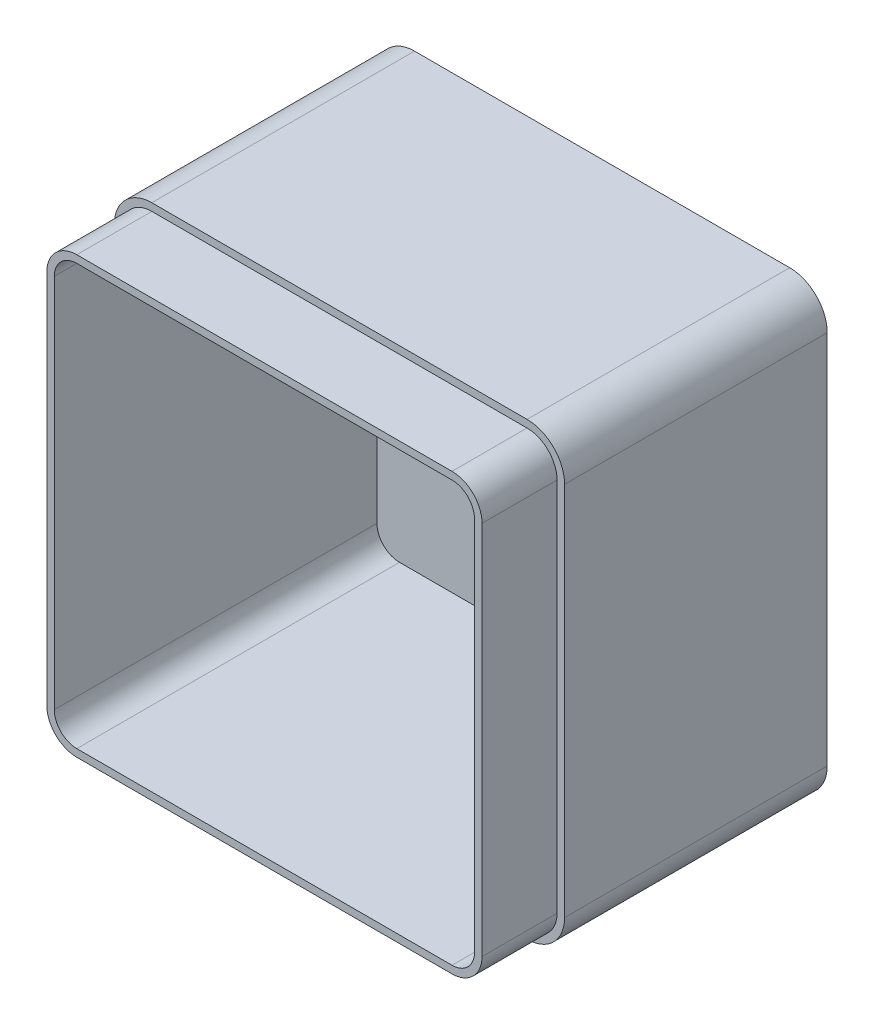
ISO-10303-21;
HEADER;
FILE_DESCRIPTION(('STEP AP214'),'2;1');
FILE_NAME('part.step','',(''),(''),'','','');
FILE_SCHEMA(('AUTOMOTIVE_DESIGN { 1 0 10303 214 1 1 1 1 }'));
ENDSEC;
DATA;
#1=APPLICATION_CONTEXT('core data for automotive mechanical design processes');
#2=APPLICATION_PROTOCOL_DEFINITION('international standard','automotive_design',2000,#1);
#3=PRODUCT_CONTEXT('',#1,'mechanical');
#4=PRODUCT('Part','Part','',(#3));
#5=PRODUCT_RELATED_PRODUCT_CATEGORY('part','',(#4));
#6=PRODUCT_DEFINITION_FORMATION('','',#4);
#7=PRODUCT_DEFINITION_CONTEXT('part definition',#1,'design');
#8=PRODUCT_DEFINITION('design','',#6,#7);
#9=PRODUCT_DEFINITION_SHAPE('','',#8);
#10=(LENGTH_UNIT() NAMED_UNIT(*) SI_UNIT(.MILLI.,.METRE.));
#11=(NAMED_UNIT(*) PLANE_ANGLE_UNIT() SI_UNIT($,.RADIAN.));
#12=(NAMED_UNIT(*) SI_UNIT($,.STERADIAN.) SOLID_ANGLE_UNIT());
#13=UNCERTAINTY_MEASURE_WITH_UNIT(LENGTH_MEASURE(1.E-05),#10,'distance_accuracy_value','');
#14=(GEOMETRIC_REPRESENTATION_CONTEXT(3) GLOBAL_UNCERTAINTY_ASSIGNED_CONTEXT((#13)) GLOBAL_UNIT_ASSIGNED_CONTEXT((#10,
#11,#12)) REPRESENTATION_CONTEXT('',''));
#15=CARTESIAN_POINT('',(0.,0.,0.));
#16=DIRECTION('',(0.,0.,1.));
#17=DIRECTION('',(1.,0.,0.));
#18=AXIS2_PLACEMENT_3D('',#15,#16,#17);
#19=CARTESIAN_POINT('',(0.,0.,90.));
#20=DIRECTION('',(0.,0.,-1.));
#21=DIRECTION('',(-1.,0.,0.));
#22=AXIS2_PLACEMENT_3D('',#19,#20,#21);
#23=PLANE('',#22);
#24=DIRECTION('',(1.,0.,0.));
#25=VECTOR('',#24,1.);
#26=CARTESIAN_POINT('',(0.,4.,90.));
#27=LINE('',#26,#25);
#28=CARTESIAN_POINT('',(9.99999999999999,4.,90.));
#29=VERTEX_POINT('',#28);
#30=CARTESIAN_POINT('',(110.,4.,90.));
#31=VERTEX_POINT('',#30);
#32=EDGE_CURVE('E385',#29,#31,#27,.T.);
#33=ORIENTED_EDGE('',*,*,#32,.F.);
#34=CARTESIAN_POINT('',(9.99999999999999,10.,90.));
#35=DIRECTION('',(0.,0.,-1.));
#36=DIRECTION('',(-1.,0.,0.));
#37=AXIS2_PLACEMENT_3D('',#34,#35,#36);
#38=CIRCLE('',#37,6.);
#39=CARTESIAN_POINT('',(4.,10.,90.));
#40=VERTEX_POINT('',#39);
#41=EDGE_CURVE('E386',#40,#29,#38,.F.);
#42=ORIENTED_EDGE('',*,*,#41,.F.);
#43=DIRECTION('',(0.,-1.,0.));
#44=VECTOR('',#43,1.);
#45=CARTESIAN_POINT('',(4.,0.,90.));
#46=LINE('',#45,#44);
#47=CARTESIAN_POINT('',(3.99999999999996,110.,90.));
#48=VERTEX_POINT('',#47);
#49=EDGE_CURVE('E358',#48,#40,#46,.T.);
#50=ORIENTED_EDGE('',*,*,#49,.F.);
#51=CARTESIAN_POINT('',(9.99999999999996,110.,90.));
#52=DIRECTION('',(0.,0.,-1.));
#53=DIRECTION('',(-1.,0.,0.));
#54=AXIS2_PLACEMENT_3D('',#51,#52,#53);
#55=CIRCLE('',#54,6.);
#56=CARTESIAN_POINT('',(9.99999999999996,116.,90.));
#57=VERTEX_POINT('',#56);
#58=EDGE_CURVE('E389',#57,#48,#55,.F.);
#59=ORIENTED_EDGE('',*,*,#58,.F.);
#60=DIRECTION('',(-1.,0.,0.));
#61=VECTOR('',#60,1.);
#62=CARTESIAN_POINT('',(0.,116.,90.));
#63=LINE('',#62,#61);
#64=CARTESIAN_POINT('',(110.,116.,90.));
#65=VERTEX_POINT('',#64);
#66=EDGE_CURVE('E375',#65,#57,#63,.T.);
#67=ORIENTED_EDGE('',*,*,#66,.F.);
#68=CARTESIAN_POINT('',(110.,110.,90.));
#69=DIRECTION('',(0.,0.,-1.));
#70=DIRECTION('',(-1.,0.,0.));
#71=AXIS2_PLACEMENT_3D('',#68,#69,#70);
#72=CIRCLE('',#71,6.);
#73=CARTESIAN_POINT('',(116.,110.,90.));
#74=VERTEX_POINT('',#73);
#75=EDGE_CURVE('E365',#74,#65,#72,.F.);
#76=ORIENTED_EDGE('',*,*,#75,.F.);
#77=DIRECTION('',(0.,1.,0.));
#78=VECTOR('',#77,1.);
#79=CARTESIAN_POINT('',(116.,0.,90.));
#80=LINE('',#79,#78);
#81=CARTESIAN_POINT('',(116.,10.,90.));
#82=VERTEX_POINT('',#81);
#83=EDGE_CURVE('E393',#82,#74,#80,.T.);
#84=ORIENTED_EDGE('',*,*,#83,.F.);
#85=CARTESIAN_POINT('',(110.,10.,90.));
#86=DIRECTION('',(0.,0.,-1.));
#87=DIRECTION('',(-1.,0.,0.));
#88=AXIS2_PLACEMENT_3D('',#85,#86,#87);
#89=CIRCLE('',#88,6.);
#90=EDGE_CURVE('E335',#31,#82,#89,.F.);
#91=ORIENTED_EDGE('',*,*,#90,.F.);
#92=EDGE_LOOP('',(#33,#42,#50,#59,#67,#76,#84,#91));
#93=FACE_BOUND('',#92,.T.);
#94=CARTESIAN_POINT('',(9.99999999999999,10.,90.));
#95=DIRECTION('',(0.,0.,1.));
#96=DIRECTION('',(1.,0.,0.));
#97=AXIS2_PLACEMENT_3D('',#94,#95,#96);
#98=CIRCLE('',#97,8.00000000000001);
#99=CARTESIAN_POINT('',(1.99999999999996,9.99999999999999,90.));
#100=VERTEX_POINT('',#99);
#101=CARTESIAN_POINT('',(9.99999999999999,2.,90.));
#102=VERTEX_POINT('',#101);
#103=EDGE_CURVE('E257',#100,#102,#98,.T.);
#104=ORIENTED_EDGE('',*,*,#103,.T.);
#105=DIRECTION('',(1.,0.,0.));
#106=VECTOR('',#105,1.);
#107=CARTESIAN_POINT('',(9.99999999999999,2.,90.));
#108=LINE('',#107,#106);
#109=CARTESIAN_POINT('',(110.,2.,90.));
#110=VERTEX_POINT('',#109);
#111=EDGE_CURVE('E207',#102,#110,#108,.T.);
#112=ORIENTED_EDGE('',*,*,#111,.T.);
#113=CARTESIAN_POINT('',(110.,10.,90.));
#114=DIRECTION('',(0.,0.,1.));
#115=DIRECTION('',(1.,0.,0.));
#116=AXIS2_PLACEMENT_3D('',#113,#114,#115);
#117=CIRCLE('',#116,7.99999999999999);
#118=CARTESIAN_POINT('',(118.,10.,90.));
#119=VERTEX_POINT('',#118);
#120=EDGE_CURVE('E55',#110,#119,#117,.T.);
#121=ORIENTED_EDGE('',*,*,#120,.T.);
#122=DIRECTION('',(0.,1.,0.));
#123=VECTOR('',#122,1.);
#124=CARTESIAN_POINT('',(118.,9.99999999999999,90.));
#125=LINE('',#124,#123);
#126=CARTESIAN_POINT('',(118.,110.,90.));
#127=VERTEX_POINT('',#126);
#128=EDGE_CURVE('E264',#119,#127,#125,.T.);
#129=ORIENTED_EDGE('',*,*,#128,.T.);
#130=CARTESIAN_POINT('',(110.,110.,90.));
#131=DIRECTION('',(0.,0.,1.));
#132=DIRECTION('',(1.,0.,0.));
#133=AXIS2_PLACEMENT_3D('',#130,#131,#132);
#134=CIRCLE('',#133,8.00000000000001);
#135=CARTESIAN_POINT('',(110.,118.,90.));
#136=VERTEX_POINT('',#135);
#137=EDGE_CURVE('E268',#127,#136,#134,.T.);
#138=ORIENTED_EDGE('',*,*,#137,.T.);
#139=DIRECTION('',(-1.,0.,0.));
#140=VECTOR('',#139,1.);
#141=CARTESIAN_POINT('',(110.,118.,90.));
#142=LINE('',#141,#140);
#143=CARTESIAN_POINT('',(9.99999999999995,118.,90.));
#144=VERTEX_POINT('',#143);
#145=EDGE_CURVE('E272',#136,#144,#142,.T.);
#146=ORIENTED_EDGE('',*,*,#145,.T.);
#147=CARTESIAN_POINT('',(9.99999999999996,110.,90.));
#148=DIRECTION('',(0.,0.,1.));
#149=DIRECTION('',(1.,0.,0.));
#150=AXIS2_PLACEMENT_3D('',#147,#148,#149);
#151=CIRCLE('',#150,7.99999999999999);
#152=CARTESIAN_POINT('',(1.99999999999997,110.,90.));
#153=VERTEX_POINT('',#152);
#154=EDGE_CURVE('E234',#144,#153,#151,.T.);
#155=ORIENTED_EDGE('',*,*,#154,.T.);
#156=DIRECTION('',(0.,-1.,0.));
#157=VECTOR('',#156,1.);
#158=CARTESIAN_POINT('',(1.99999999999996,110.,90.));
#159=LINE('',#158,#157);
#160=EDGE_CURVE('E230',#153,#100,#159,.T.);
#161=ORIENTED_EDGE('',*,*,#160,.T.);
#162=EDGE_LOOP('',(#104,#112,#121,#129,#138,#146,#155,#161));
#163=FACE_BOUND('',#162,.T.);
#164=ADVANCED_FACE('F39',(#93,#163),#23,.F.);
#165=CARTESIAN_POINT('',(4.,0.,90.));
#166=DIRECTION('',(1.,0.,0.));
#167=DIRECTION('',(0.,1.,0.));
#168=AXIS2_PLACEMENT_3D('',#165,#166,#167);
#169=PLANE('',#168);
#170=DIRECTION('',(0.,-1.,0.));
#171=VECTOR('',#170,1.);
#172=CARTESIAN_POINT('',(4.,0.,4.));
#173=LINE('',#172,#171);
#174=CARTESIAN_POINT('',(3.99999999999996,110.,4.));
#175=VERTEX_POINT('',#174);
#176=CARTESIAN_POINT('',(4.,10.,4.));
#177=VERTEX_POINT('',#176);
#178=EDGE_CURVE('E321',#175,#177,#173,.T.);
#179=ORIENTED_EDGE('',*,*,#178,.F.);
#180=DIRECTION('',(0.,0.,1.));
#181=VECTOR('',#180,1.);
#182=CARTESIAN_POINT('',(3.99999999999996,110.,90.));
#183=LINE('',#182,#181);
#184=EDGE_CURVE('E331',#48,#175,#183,.F.);
#185=ORIENTED_EDGE('',*,*,#184,.F.);
#186=ORIENTED_EDGE('',*,*,#49,.T.);
#187=DIRECTION('',(0.,0.,1.));
#188=VECTOR('',#187,1.);
#189=CARTESIAN_POINT('',(4.,10.,90.));
#190=LINE('',#189,#188);
#191=EDGE_CURVE('E326',#177,#40,#190,.T.);
#192=ORIENTED_EDGE('',*,*,#191,.F.);
#193=EDGE_LOOP('',(#179,#185,#186,#192));
#194=FACE_BOUND('',#193,.T.);
#195=ADVANCED_FACE('F504',(#194),#169,.T.);
#196=CARTESIAN_POINT('',(0.,4.,90.));
#197=DIRECTION('',(0.,1.,0.));
#198=DIRECTION('',(0.,0.,1.));
#199=AXIS2_PLACEMENT_3D('',#196,#197,#198);
#200=PLANE('',#199);
#201=DIRECTION('',(1.,0.,0.));
#202=VECTOR('',#201,1.);
#203=CARTESIAN_POINT('',(0.,4.,4.));
#204=LINE('',#203,#202);
#205=CARTESIAN_POINT('',(9.99999999999999,4.,4.));
#206=VERTEX_POINT('',#205);
#207=CARTESIAN_POINT('',(110.,4.,4.));
#208=VERTEX_POINT('',#207);
#209=EDGE_CURVE('E325',#206,#208,#204,.T.);
#210=ORIENTED_EDGE('',*,*,#209,.F.);
#211=DIRECTION('',(0.,0.,1.));
#212=VECTOR('',#211,1.);
#213=CARTESIAN_POINT('',(9.99999999999999,4.,90.));
#214=LINE('',#213,#212);
#215=EDGE_CURVE('E344',#29,#206,#214,.F.);
#216=ORIENTED_EDGE('',*,*,#215,.F.);
#217=ORIENTED_EDGE('',*,*,#32,.T.);
#218=DIRECTION('',(0.,0.,1.));
#219=VECTOR('',#218,1.);
#220=CARTESIAN_POINT('',(110.,4.,90.));
#221=LINE('',#220,#219);
#222=EDGE_CURVE('E362',#208,#31,#221,.T.);
#223=ORIENTED_EDGE('',*,*,#222,.F.);
#224=EDGE_LOOP('',(#210,#216,#217,#223));
#225=FACE_BOUND('',#224,.T.);
#226=ADVANCED_FACE('F510',(#225),#200,.T.);
#227=CARTESIAN_POINT('',(116.,0.,90.));
#228=DIRECTION('',(-1.,0.,0.));
#229=DIRECTION('',(0.,-1.,0.));
#230=AXIS2_PLACEMENT_3D('',#227,#228,#229);
#231=PLANE('',#230);
#232=ORIENTED_EDGE('',*,*,#83,.T.);
#233=DIRECTION('',(0.,0.,1.));
#234=VECTOR('',#233,1.);
#235=CARTESIAN_POINT('',(116.,110.,90.));
#236=LINE('',#235,#234);
#237=CARTESIAN_POINT('',(116.,110.,4.));
#238=VERTEX_POINT('',#237);
#239=EDGE_CURVE('E372',#238,#74,#236,.T.);
#240=ORIENTED_EDGE('',*,*,#239,.F.);
#241=DIRECTION('',(0.,1.,0.));
#242=VECTOR('',#241,1.);
#243=CARTESIAN_POINT('',(116.,0.,4.));
#244=LINE('',#243,#242);
#245=CARTESIAN_POINT('',(116.,10.,4.));
#246=VERTEX_POINT('',#245);
#247=EDGE_CURVE('E336',#246,#238,#244,.T.);
#248=ORIENTED_EDGE('',*,*,#247,.F.);
#249=DIRECTION('',(0.,0.,1.));
#250=VECTOR('',#249,1.);
#251=CARTESIAN_POINT('',(116.,10.,90.));
#252=LINE('',#251,#250);
#253=EDGE_CURVE('E361',#82,#246,#252,.F.);
#254=ORIENTED_EDGE('',*,*,#253,.F.);
#255=EDGE_LOOP('',(#232,#240,#248,#254));
#256=FACE_BOUND('',#255,.T.);
#257=ADVANCED_FACE('F704',(#256),#231,.T.);
#258=CARTESIAN_POINT('',(0.,116.,90.));
#259=DIRECTION('',(0.,-1.,0.));
#260=DIRECTION('',(0.,0.,-1.));
#261=AXIS2_PLACEMENT_3D('',#258,#259,#260);
#262=PLANE('',#261);
#263=DIRECTION('',(-1.,0.,0.));
#264=VECTOR('',#263,1.);
#265=CARTESIAN_POINT('',(0.,116.,4.));
#266=LINE('',#265,#264);
#267=CARTESIAN_POINT('',(110.,116.,4.));
#268=VERTEX_POINT('',#267);
#269=CARTESIAN_POINT('',(9.99999999999996,116.,4.));
#270=VERTEX_POINT('',#269);
#271=EDGE_CURVE('E340',#268,#270,#266,.T.);
#272=ORIENTED_EDGE('',*,*,#271,.F.);
#273=DIRECTION('',(0.,0.,-1.));
#274=VECTOR('',#273,1.);
#275=CARTESIAN_POINT('',(110.,116.,90.));
#276=LINE('',#275,#274);
#277=EDGE_CURVE('E330',#65,#268,#276,.T.);
#278=ORIENTED_EDGE('',*,*,#277,.F.);
#279=ORIENTED_EDGE('',*,*,#66,.T.);
#280=DIRECTION('',(0.,0.,-1.));
#281=VECTOR('',#280,1.);
#282=CARTESIAN_POINT('',(9.99999999999996,116.,90.));
#283=LINE('',#282,#281);
#284=EDGE_CURVE('E379',#270,#57,#283,.F.);
#285=ORIENTED_EDGE('',*,*,#284,.F.);
#286=EDGE_LOOP('',(#272,#278,#279,#285));
#287=FACE_BOUND('',#286,.T.);
#288=ADVANCED_FACE('F694',(#287),#262,.T.);
#289=CARTESIAN_POINT('',(0.,0.,4.));
#290=DIRECTION('',(0.,0.,-1.));
#291=DIRECTION('',(-1.,0.,0.));
#292=AXIS2_PLACEMENT_3D('',#289,#290,#291);
#293=PLANE('',#292);
#294=ORIENTED_EDGE('',*,*,#247,.T.);
#295=CARTESIAN_POINT('',(110.,110.,4.));
#296=DIRECTION('',(0.,0.,-1.));
#297=DIRECTION('',(-1.,0.,0.));
#298=AXIS2_PLACEMENT_3D('',#295,#296,#297);
#299=CIRCLE('',#298,6.);
#300=EDGE_CURVE('E354',#268,#238,#299,.T.);
#301=ORIENTED_EDGE('',*,*,#300,.F.);
#302=ORIENTED_EDGE('',*,*,#271,.T.);
#303=CARTESIAN_POINT('',(9.99999999999996,110.,4.));
#304=DIRECTION('',(0.,0.,-1.));
#305=DIRECTION('',(-1.,0.,0.));
#306=AXIS2_PLACEMENT_3D('',#303,#304,#305);
#307=CIRCLE('',#306,6.);
#308=EDGE_CURVE('E351',#175,#270,#307,.T.);
#309=ORIENTED_EDGE('',*,*,#308,.F.);
#310=ORIENTED_EDGE('',*,*,#178,.T.);
#311=CARTESIAN_POINT('',(9.99999999999999,10.,4.));
#312=DIRECTION('',(0.,0.,-1.));
#313=DIRECTION('',(-1.,0.,0.));
#314=AXIS2_PLACEMENT_3D('',#311,#312,#313);
#315=CIRCLE('',#314,6.);
#316=EDGE_CURVE('E345',#206,#177,#315,.T.);
#317=ORIENTED_EDGE('',*,*,#316,.F.);
#318=ORIENTED_EDGE('',*,*,#209,.T.);
#319=CARTESIAN_POINT('',(110.,10.,4.));
#320=DIRECTION('',(0.,0.,-1.));
#321=DIRECTION('',(-1.,0.,0.));
#322=AXIS2_PLACEMENT_3D('',#319,#320,#321);
#323=CIRCLE('',#322,6.);
#324=EDGE_CURVE('E341',#246,#208,#323,.T.);
#325=ORIENTED_EDGE('',*,*,#324,.F.);
#326=EDGE_LOOP('',(#294,#301,#302,#309,#310,#317,#318,#325));
#327=FACE_BOUND('',#326,.T.);
#328=ADVANCED_FACE('F684',(#327),#293,.F.);
#329=CARTESIAN_POINT('',(110.,10.,90.));
#330=DIRECTION('',(0.,0.,-1.));
#331=DIRECTION('',(-1.,0.,0.));
#332=AXIS2_PLACEMENT_3D('',#329,#330,#331);
#333=CYLINDRICAL_SURFACE('',#332,6.);
#334=ORIENTED_EDGE('',*,*,#90,.T.);
#335=ORIENTED_EDGE('',*,*,#253,.T.);
#336=ORIENTED_EDGE('',*,*,#324,.T.);
#337=ORIENTED_EDGE('',*,*,#222,.T.);
#338=EDGE_LOOP('',(#334,#335,#336,#337));
#339=FACE_BOUND('',#338,.T.);
#340=ADVANCED_FACE('F674',(#339),#333,.F.);
#341=CARTESIAN_POINT('',(9.99999999999999,10.,90.));
#342=DIRECTION('',(0.,0.,-1.));
#343=DIRECTION('',(-1.,0.,0.));
#344=AXIS2_PLACEMENT_3D('',#341,#342,#343);
#345=CYLINDRICAL_SURFACE('',#344,6.);
#346=ORIENTED_EDGE('',*,*,#41,.T.);
#347=ORIENTED_EDGE('',*,*,#215,.T.);
#348=ORIENTED_EDGE('',*,*,#316,.T.);
#349=ORIENTED_EDGE('',*,*,#191,.T.);
#350=EDGE_LOOP('',(#346,#347,#348,#349));
#351=FACE_BOUND('',#350,.T.);
#352=ADVANCED_FACE('F665',(#351),#345,.F.);
#353=CARTESIAN_POINT('',(9.99999999999996,110.,90.));
#354=DIRECTION('',(0.,0.,-1.));
#355=DIRECTION('',(-1.,0.,0.));
#356=AXIS2_PLACEMENT_3D('',#353,#354,#355);
#357=CYLINDRICAL_SURFACE('',#356,6.);
#358=ORIENTED_EDGE('',*,*,#58,.T.);
#359=ORIENTED_EDGE('',*,*,#184,.T.);
#360=ORIENTED_EDGE('',*,*,#308,.T.);
#361=ORIENTED_EDGE('',*,*,#284,.T.);
#362=EDGE_LOOP('',(#358,#359,#360,#361));
#363=FACE_BOUND('',#362,.T.);
#364=ADVANCED_FACE('F656',(#363),#357,.F.);
#365=CARTESIAN_POINT('',(110.,110.,90.));
#366=DIRECTION('',(0.,0.,-1.));
#367=DIRECTION('',(-1.,0.,0.));
#368=AXIS2_PLACEMENT_3D('',#365,#366,#367);
#369=CYLINDRICAL_SURFACE('',#368,6.);
#370=ORIENTED_EDGE('',*,*,#75,.T.);
#371=ORIENTED_EDGE('',*,*,#277,.T.);
#372=ORIENTED_EDGE('',*,*,#300,.T.);
#373=ORIENTED_EDGE('',*,*,#239,.T.);
#374=EDGE_LOOP('',(#370,#371,#372,#373));
#375=FACE_BOUND('',#374,.T.);
#376=ADVANCED_FACE('F517',(#375),#369,.F.);
#377=CARTESIAN_POINT('',(9.99999999999999,10.,70.));
#378=DIRECTION('',(0.,0.,1.));
#379=DIRECTION('',(1.,0.,0.));
#380=AXIS2_PLACEMENT_3D('',#377,#378,#379);
#381=PLANE('',#380);
#382=DIRECTION('',(0.,-1.,0.));
#383=VECTOR('',#382,1.);
#384=CARTESIAN_POINT('',(1.99999999999996,110.,70.));
#385=LINE('',#384,#383);
#386=CARTESIAN_POINT('',(1.99999999999997,110.,70.));
#387=VERTEX_POINT('',#386);
#388=CARTESIAN_POINT('',(1.99999999999996,9.99999999999999,70.));
#389=VERTEX_POINT('',#388);
#390=EDGE_CURVE('E214',#387,#389,#385,.T.);
#391=ORIENTED_EDGE('',*,*,#390,.F.);
#392=CARTESIAN_POINT('',(9.99999999999996,110.,70.));
#393=DIRECTION('',(0.,0.,1.));
#394=DIRECTION('',(1.,0.,0.));
#395=AXIS2_PLACEMENT_3D('',#392,#393,#394);
#396=CIRCLE('',#395,7.99999999999999);
#397=CARTESIAN_POINT('',(9.99999999999995,118.,70.));
#398=VERTEX_POINT('',#397);
#399=EDGE_CURVE('E251',#398,#387,#396,.T.);
#400=ORIENTED_EDGE('',*,*,#399,.F.);
#401=DIRECTION('',(-1.,0.,0.));
#402=VECTOR('',#401,1.);
#403=CARTESIAN_POINT('',(110.,118.,70.));
#404=LINE('',#403,#402);
#405=CARTESIAN_POINT('',(110.,118.,70.));
#406=VERTEX_POINT('',#405);
#407=EDGE_CURVE('E247',#406,#398,#404,.T.);
#408=ORIENTED_EDGE('',*,*,#407,.F.);
#409=CARTESIAN_POINT('',(110.,110.,70.));
#410=DIRECTION('',(0.,0.,1.));
#411=DIRECTION('',(1.,0.,0.));
#412=AXIS2_PLACEMENT_3D('',#409,#410,#411);
#413=CIRCLE('',#412,8.00000000000001);
#414=CARTESIAN_POINT('',(118.,110.,70.));
#415=VERTEX_POINT('',#414);
#416=EDGE_CURVE('E243',#415,#406,#413,.T.);
#417=ORIENTED_EDGE('',*,*,#416,.F.);
#418=DIRECTION('',(0.,1.,0.));
#419=VECTOR('',#418,1.);
#420=CARTESIAN_POINT('',(118.,9.99999999999999,70.));
#421=LINE('',#420,#419);
#422=CARTESIAN_POINT('',(118.,10.,70.));
#423=VERTEX_POINT('',#422);
#424=EDGE_CURVE('E239',#423,#415,#421,.T.);
#425=ORIENTED_EDGE('',*,*,#424,.F.);
#426=CARTESIAN_POINT('',(110.,10.,70.));
#427=DIRECTION('',(0.,0.,1.));
#428=DIRECTION('',(1.,0.,0.));
#429=AXIS2_PLACEMENT_3D('',#426,#427,#428);
#430=CIRCLE('',#429,7.99999999999999);
#431=CARTESIAN_POINT('',(110.,2.,70.));
#432=VERTEX_POINT('',#431);
#433=EDGE_CURVE('E224',#432,#423,#430,.T.);
#434=ORIENTED_EDGE('',*,*,#433,.F.);
#435=DIRECTION('',(1.,0.,0.));
#436=VECTOR('',#435,1.);
#437=CARTESIAN_POINT('',(9.99999999999999,2.,70.));
#438=LINE('',#437,#436);
#439=CARTESIAN_POINT('',(9.99999999999999,2.,70.));
#440=VERTEX_POINT('',#439);
#441=EDGE_CURVE('E205',#440,#432,#438,.T.);
#442=ORIENTED_EDGE('',*,*,#441,.F.);
#443=CARTESIAN_POINT('',(9.99999999999999,10.,70.));
#444=DIRECTION('',(0.,0.,1.));
#445=DIRECTION('',(1.,0.,0.));
#446=AXIS2_PLACEMENT_3D('',#443,#444,#445);
#447=CIRCLE('',#446,8.00000000000001);
#448=EDGE_CURVE('E220',#389,#440,#447,.T.);
#449=ORIENTED_EDGE('',*,*,#448,.F.);
#450=EDGE_LOOP('',(#391,#400,#408,#417,#425,#434,#442,#449));
#451=FACE_BOUND('',#450,.T.);
#452=CARTESIAN_POINT('',(9.99999999999999,10.,70.));
#453=DIRECTION('',(0.,0.,1.));
#454=DIRECTION('',(1.,0.,0.));
#455=AXIS2_PLACEMENT_3D('',#452,#453,#454);
#456=CIRCLE('',#455,10.);
#457=CARTESIAN_POINT('',(0.,9.99999999999999,70.));
#458=VERTEX_POINT('',#457);
#459=CARTESIAN_POINT('',(9.99999999999999,0.,70.));
#460=VERTEX_POINT('',#459);
#461=EDGE_CURVE('E281',#458,#460,#456,.T.);
#462=ORIENTED_EDGE('',*,*,#461,.T.);
#463=DIRECTION('',(1.,0.,0.));
#464=VECTOR('',#463,1.);
#465=CARTESIAN_POINT('',(9.99999999999999,0.,70.));
#466=LINE('',#465,#464);
#467=CARTESIAN_POINT('',(110.,0.,70.));
#468=VERTEX_POINT('',#467);
#469=EDGE_CURVE('E301',#460,#468,#466,.T.);
#470=ORIENTED_EDGE('',*,*,#469,.T.);
#471=CARTESIAN_POINT('',(110.,10.,70.));
#472=DIRECTION('',(0.,0.,1.));
#473=DIRECTION('',(1.,0.,0.));
#474=AXIS2_PLACEMENT_3D('',#471,#472,#473);
#475=CIRCLE('',#474,9.99999999999999);
#476=CARTESIAN_POINT('',(120.,10.,70.));
#477=VERTEX_POINT('',#476);
#478=EDGE_CURVE('E304',#468,#477,#475,.T.);
#479=ORIENTED_EDGE('',*,*,#478,.T.);
#480=DIRECTION('',(0.,1.,0.));
#481=VECTOR('',#480,1.);
#482=CARTESIAN_POINT('',(120.,10.,70.));
#483=LINE('',#482,#481);
#484=CARTESIAN_POINT('',(120.,110.,70.));
#485=VERTEX_POINT('',#484);
#486=EDGE_CURVE('E63',#477,#485,#483,.T.);
#487=ORIENTED_EDGE('',*,*,#486,.T.);
#488=CARTESIAN_POINT('',(110.,110.,70.));
#489=DIRECTION('',(0.,0.,1.));
#490=DIRECTION('',(1.,0.,0.));
#491=AXIS2_PLACEMENT_3D('',#488,#489,#490);
#492=CIRCLE('',#491,9.99999999999999);
#493=CARTESIAN_POINT('',(110.,120.,70.));
#494=VERTEX_POINT('',#493);
#495=EDGE_CURVE('E309',#485,#494,#492,.T.);
#496=ORIENTED_EDGE('',*,*,#495,.T.);
#497=DIRECTION('',(-1.,0.,0.));
#498=VECTOR('',#497,1.);
#499=CARTESIAN_POINT('',(110.,120.,70.));
#500=LINE('',#499,#498);
#501=CARTESIAN_POINT('',(9.99999999999996,120.,70.));
#502=VERTEX_POINT('',#501);
#503=EDGE_CURVE('E312',#494,#502,#500,.T.);
#504=ORIENTED_EDGE('',*,*,#503,.T.);
#505=CARTESIAN_POINT('',(9.99999999999996,110.,70.));
#506=DIRECTION('',(0.,0.,1.));
#507=DIRECTION('',(1.,0.,0.));
#508=AXIS2_PLACEMENT_3D('',#505,#506,#507);
#509=CIRCLE('',#508,9.99999999999999);
#510=CARTESIAN_POINT('',(0.,110.,70.));
#511=VERTEX_POINT('',#510);
#512=EDGE_CURVE('E315',#502,#511,#509,.T.);
#513=ORIENTED_EDGE('',*,*,#512,.T.);
#514=DIRECTION('',(0.,-1.,0.));
#515=VECTOR('',#514,1.);
#516=CARTESIAN_POINT('',(0.,110.,70.));
#517=LINE('',#516,#515);
#518=EDGE_CURVE('E318',#511,#458,#517,.T.);
#519=ORIENTED_EDGE('',*,*,#518,.T.);
#520=EDGE_LOOP('',(#462,#470,#479,#487,#496,#504,#513,#519));
#521=FACE_BOUND('',#520,.T.);
#522=ADVANCED_FACE('F219',(#451,#521),#381,.T.);
#523=CARTESIAN_POINT('',(9.99999999999999,10.,70.));
#524=DIRECTION('',(0.,0.,1.));
#525=DIRECTION('',(1.,0.,0.));
#526=AXIS2_PLACEMENT_3D('',#523,#524,#525);
#527=CYLINDRICAL_SURFACE('',#526,8.00000000000001);
#528=ORIENTED_EDGE('',*,*,#103,.F.);
#529=DIRECTION('',(0.,0.,1.));
#530=VECTOR('',#529,1.);
#531=CARTESIAN_POINT('',(1.99999999999996,9.99999999999999,70.));
#532=LINE('',#531,#530);
#533=EDGE_CURVE('E228',#389,#100,#532,.T.);
#534=ORIENTED_EDGE('',*,*,#533,.F.);
#535=ORIENTED_EDGE('',*,*,#448,.T.);
#536=DIRECTION('',(0.,0.,1.));
#537=VECTOR('',#536,1.);
#538=CARTESIAN_POINT('',(9.99999999999999,2.,70.));
#539=LINE('',#538,#537);
#540=EDGE_CURVE('E202',#440,#102,#539,.T.);
#541=ORIENTED_EDGE('',*,*,#540,.T.);
#542=EDGE_LOOP('',(#528,#534,#535,#541));
#543=FACE_BOUND('',#542,.T.);
#544=ADVANCED_FACE('F227',(#543),#527,.T.);
#545=CARTESIAN_POINT('',(1.99999999999996,110.,70.));
#546=DIRECTION('',(-1.,0.,0.));
#547=DIRECTION('',(0.,-1.,0.));
#548=AXIS2_PLACEMENT_3D('',#545,#546,#547);
#549=PLANE('',#548);
#550=ORIENTED_EDGE('',*,*,#160,.F.);
#551=DIRECTION('',(0.,0.,1.));
#552=VECTOR('',#551,1.);
#553=CARTESIAN_POINT('',(1.99999999999997,110.,70.));
#554=LINE('',#553,#552);
#555=EDGE_CURVE('E282',#387,#153,#554,.T.);
#556=ORIENTED_EDGE('',*,*,#555,.F.);
#557=ORIENTED_EDGE('',*,*,#390,.T.);
#558=ORIENTED_EDGE('',*,*,#533,.T.);
#559=EDGE_LOOP('',(#550,#556,#557,#558));
#560=FACE_BOUND('',#559,.T.);
#561=ADVANCED_FACE('F560',(#560),#549,.T.);
#562=CARTESIAN_POINT('',(9.99999999999996,110.,70.));
#563=DIRECTION('',(0.,0.,1.));
#564=DIRECTION('',(1.,0.,0.));
#565=AXIS2_PLACEMENT_3D('',#562,#563,#564);
#566=CYLINDRICAL_SURFACE('',#565,7.99999999999999);
#567=ORIENTED_EDGE('',*,*,#154,.F.);
#568=DIRECTION('',(0.,0.,1.));
#569=VECTOR('',#568,1.);
#570=CARTESIAN_POINT('',(9.99999999999995,118.,70.));
#571=LINE('',#570,#569);
#572=EDGE_CURVE('E285',#398,#144,#571,.T.);
#573=ORIENTED_EDGE('',*,*,#572,.F.);
#574=ORIENTED_EDGE('',*,*,#399,.T.);
#575=ORIENTED_EDGE('',*,*,#555,.T.);
#576=EDGE_LOOP('',(#567,#573,#574,#575));
#577=FACE_BOUND('',#576,.T.);
#578=ADVANCED_FACE('F568',(#577),#566,.T.);
#579=CARTESIAN_POINT('',(110.,118.,70.));
#580=DIRECTION('',(0.,1.,0.));
#581=DIRECTION('',(0.,0.,1.));
#582=AXIS2_PLACEMENT_3D('',#579,#580,#581);
#583=PLANE('',#582);
#584=ORIENTED_EDGE('',*,*,#145,.F.);
#585=DIRECTION('',(0.,0.,1.));
#586=VECTOR('',#585,1.);
#587=CARTESIAN_POINT('',(110.,118.,70.));
#588=LINE('',#587,#586);
#589=EDGE_CURVE('E288',#406,#136,#588,.T.);
#590=ORIENTED_EDGE('',*,*,#589,.F.);
#591=ORIENTED_EDGE('',*,*,#407,.T.);
#592=ORIENTED_EDGE('',*,*,#572,.T.);
#593=EDGE_LOOP('',(#584,#590,#591,#592));
#594=FACE_BOUND('',#593,.T.);
#595=ADVANCED_FACE('F577',(#594),#583,.T.);
#596=CARTESIAN_POINT('',(110.,110.,70.));
#597=DIRECTION('',(0.,0.,1.));
#598=DIRECTION('',(1.,0.,0.));
#599=AXIS2_PLACEMENT_3D('',#596,#597,#598);
#600=CYLINDRICAL_SURFACE('',#599,8.00000000000001);
#601=ORIENTED_EDGE('',*,*,#137,.F.);
#602=DIRECTION('',(0.,0.,1.));
#603=VECTOR('',#602,1.);
#604=CARTESIAN_POINT('',(118.,110.,70.));
#605=LINE('',#604,#603);
#606=EDGE_CURVE('E291',#415,#127,#605,.T.);
#607=ORIENTED_EDGE('',*,*,#606,.F.);
#608=ORIENTED_EDGE('',*,*,#416,.T.);
#609=ORIENTED_EDGE('',*,*,#589,.T.);
#610=EDGE_LOOP('',(#601,#607,#608,#609));
#611=FACE_BOUND('',#610,.T.);
#612=ADVANCED_FACE('F586',(#611),#600,.T.);
#613=CARTESIAN_POINT('',(118.,9.99999999999999,70.));
#614=DIRECTION('',(1.,0.,0.));
#615=DIRECTION('',(0.,0.,-1.));
#616=AXIS2_PLACEMENT_3D('',#613,#614,#615);
#617=PLANE('',#616);
#618=ORIENTED_EDGE('',*,*,#128,.F.);
#619=DIRECTION('',(0.,0.,1.));
#620=VECTOR('',#619,1.);
#621=CARTESIAN_POINT('',(118.,10.,70.));
#622=LINE('',#621,#620);
#623=EDGE_CURVE('E294',#423,#119,#622,.T.);
#624=ORIENTED_EDGE('',*,*,#623,.F.);
#625=ORIENTED_EDGE('',*,*,#424,.T.);
#626=ORIENTED_EDGE('',*,*,#606,.T.);
#627=EDGE_LOOP('',(#618,#624,#625,#626));
#628=FACE_BOUND('',#627,.T.);
#629=ADVANCED_FACE('F595',(#628),#617,.T.);
#630=CARTESIAN_POINT('',(110.,10.,70.));
#631=DIRECTION('',(0.,0.,1.));
#632=DIRECTION('',(1.,0.,0.));
#633=AXIS2_PLACEMENT_3D('',#630,#631,#632);
#634=CYLINDRICAL_SURFACE('',#633,7.99999999999999);
#635=ORIENTED_EDGE('',*,*,#120,.F.);
#636=DIRECTION('',(0.,0.,1.));
#637=VECTOR('',#636,1.);
#638=CARTESIAN_POINT('',(110.,2.,70.));
#639=LINE('',#638,#637);
#640=EDGE_CURVE('E213',#432,#110,#639,.T.);
#641=ORIENTED_EDGE('',*,*,#640,.F.);
#642=ORIENTED_EDGE('',*,*,#433,.T.);
#643=ORIENTED_EDGE('',*,*,#623,.T.);
#644=EDGE_LOOP('',(#635,#641,#642,#643));
#645=FACE_BOUND('',#644,.T.);
#646=ADVANCED_FACE('F604',(#645),#634,.T.);
#647=CARTESIAN_POINT('',(9.99999999999999,2.,70.));
#648=DIRECTION('',(0.,-1.,0.));
#649=DIRECTION('',(0.,0.,-1.));
#650=AXIS2_PLACEMENT_3D('',#647,#648,#649);
#651=PLANE('',#650);
#652=ORIENTED_EDGE('',*,*,#111,.F.);
#653=ORIENTED_EDGE('',*,*,#540,.F.);
#654=ORIENTED_EDGE('',*,*,#441,.T.);
#655=ORIENTED_EDGE('',*,*,#640,.T.);
#656=EDGE_LOOP('',(#652,#653,#654,#655));
#657=FACE_BOUND('',#656,.T.);
#658=ADVANCED_FACE('F204',(#657),#651,.T.);
#659=CARTESIAN_POINT('',(0.,0.,0.));
#660=DIRECTION('',(0.,0.,-1.));
#661=DIRECTION('',(-1.,0.,0.));
#662=AXIS2_PLACEMENT_3D('',#659,#660,#661);
#663=PLANE('',#662);
#664=DIRECTION('',(0.,1.,0.));
#665=VECTOR('',#664,1.);
#666=CARTESIAN_POINT('',(120.,0.,0.));
#667=LINE('',#666,#665);
#668=CARTESIAN_POINT('',(120.,10.,0.));
#669=VERTEX_POINT('',#668);
#670=CARTESIAN_POINT('',(120.,110.,0.));
#671=VERTEX_POINT('',#670);
#672=EDGE_CURVE('E413',#669,#671,#667,.T.);
#673=ORIENTED_EDGE('',*,*,#672,.F.);
#674=CARTESIAN_POINT('',(110.,10.,0.));
#675=DIRECTION('',(0.,0.,-1.));
#676=DIRECTION('',(-1.,0.,0.));
#677=AXIS2_PLACEMENT_3D('',#674,#675,#676);
#678=CIRCLE('',#677,10.);
#679=CARTESIAN_POINT('',(110.,0.,0.));
#680=VERTEX_POINT('',#679);
#681=EDGE_CURVE('E437',#669,#680,#678,.T.);
#682=ORIENTED_EDGE('',*,*,#681,.T.);
#683=DIRECTION('',(1.,0.,0.));
#684=VECTOR('',#683,1.);
#685=CARTESIAN_POINT('',(0.,0.,0.));
#686=LINE('',#685,#684);
#687=CARTESIAN_POINT('',(9.99999999999999,0.,0.));
#688=VERTEX_POINT('',#687);
#689=EDGE_CURVE('E409',#688,#680,#686,.T.);
#690=ORIENTED_EDGE('',*,*,#689,.F.);
#691=CARTESIAN_POINT('',(9.99999999999999,10.,0.));
#692=DIRECTION('',(0.,0.,-1.));
#693=DIRECTION('',(-1.,0.,0.));
#694=AXIS2_PLACEMENT_3D('',#691,#692,#693);
#695=CIRCLE('',#694,10.);
#696=CARTESIAN_POINT('',(0.,9.99999999999999,0.));
#697=VERTEX_POINT('',#696);
#698=EDGE_CURVE('E434',#688,#697,#695,.T.);
#699=ORIENTED_EDGE('',*,*,#698,.T.);
#700=DIRECTION('',(0.,-1.,0.));
#701=VECTOR('',#700,1.);
#702=CARTESIAN_POINT('',(0.,0.,0.));
#703=LINE('',#702,#701);
#704=CARTESIAN_POINT('',(0.,110.,0.));
#705=VERTEX_POINT('',#704);
#706=EDGE_CURVE('E382',#705,#697,#703,.T.);
#707=ORIENTED_EDGE('',*,*,#706,.F.);
#708=CARTESIAN_POINT('',(9.99999999999996,110.,0.));
#709=DIRECTION('',(0.,0.,-1.));
#710=DIRECTION('',(-1.,0.,0.));
#711=AXIS2_PLACEMENT_3D('',#708,#709,#710);
#712=CIRCLE('',#711,10.);
#713=CARTESIAN_POINT('',(9.99999999999996,120.,0.));
#714=VERTEX_POINT('',#713);
#715=EDGE_CURVE('E431',#705,#714,#712,.T.);
#716=ORIENTED_EDGE('',*,*,#715,.T.);
#717=DIRECTION('',(-1.,0.,0.));
#718=VECTOR('',#717,1.);
#719=CARTESIAN_POINT('',(0.,120.,0.));
#720=LINE('',#719,#718);
#721=CARTESIAN_POINT('',(110.,120.,0.));
#722=VERTEX_POINT('',#721);
#723=EDGE_CURVE('E417',#722,#714,#720,.T.);
#724=ORIENTED_EDGE('',*,*,#723,.F.);
#725=CARTESIAN_POINT('',(110.,110.,0.));
#726=DIRECTION('',(0.,0.,-1.));
#727=DIRECTION('',(-1.,0.,0.));
#728=AXIS2_PLACEMENT_3D('',#725,#726,#727);
#729=CIRCLE('',#728,10.);
#730=EDGE_CURVE('E428',#722,#671,#729,.T.);
#731=ORIENTED_EDGE('',*,*,#730,.T.);
#732=EDGE_LOOP('',(#673,#682,#690,#699,#707,#716,#724,#731));
#733=FACE_BOUND('',#732,.T.);
#734=ADVANCED_FACE('F465',(#733),#663,.T.);
#735=CARTESIAN_POINT('',(9.99999999999996,110.,90.));
#736=DIRECTION('',(0.,0.,-1.));
#737=DIRECTION('',(-1.,0.,0.));
#738=AXIS2_PLACEMENT_3D('',#735,#736,#737);
#739=CYLINDRICAL_SURFACE('',#738,10.);
#740=DIRECTION('',(0.,0.,-1.));
#741=VECTOR('',#740,1.);
#742=CARTESIAN_POINT('',(0.,110.,90.));
#743=LINE('',#742,#741);
#744=EDGE_CURVE('E447',#511,#705,#743,.T.);
#745=ORIENTED_EDGE('',*,*,#744,.F.);
#746=ORIENTED_EDGE('',*,*,#512,.F.);
#747=DIRECTION('',(0.,0.,-1.));
#748=VECTOR('',#747,1.);
#749=CARTESIAN_POINT('',(9.99999999999996,120.,90.));
#750=LINE('',#749,#748);
#751=EDGE_CURVE('E11',#714,#502,#750,.F.);
#752=ORIENTED_EDGE('',*,*,#751,.F.);
#753=ORIENTED_EDGE('',*,*,#715,.F.);
#754=EDGE_LOOP('',(#745,#746,#752,#753));
#755=FACE_BOUND('',#754,.T.);
#756=ADVANCED_FACE('F470',(#755),#739,.T.);
#757=CARTESIAN_POINT('',(110.,110.,90.));
#758=DIRECTION('',(0.,0.,-1.));
#759=DIRECTION('',(-1.,0.,0.));
#760=AXIS2_PLACEMENT_3D('',#757,#758,#759);
#761=CYLINDRICAL_SURFACE('',#760,10.);
#762=DIRECTION('',(0.,0.,-1.));
#763=VECTOR('',#762,1.);
#764=CARTESIAN_POINT('',(110.,120.,90.));
#765=LINE('',#764,#763);
#766=EDGE_CURVE('E48',#494,#722,#765,.T.);
#767=ORIENTED_EDGE('',*,*,#766,.F.);
#768=ORIENTED_EDGE('',*,*,#495,.F.);
#769=DIRECTION('',(0.,0.,-1.));
#770=VECTOR('',#769,1.);
#771=CARTESIAN_POINT('',(120.,110.,90.));
#772=LINE('',#771,#770);
#773=EDGE_CURVE('E421',#671,#485,#772,.F.);
#774=ORIENTED_EDGE('',*,*,#773,.F.);
#775=ORIENTED_EDGE('',*,*,#730,.F.);
#776=EDGE_LOOP('',(#767,#768,#774,#775));
#777=FACE_BOUND('',#776,.T.);
#778=ADVANCED_FACE('F41',(#777),#761,.T.);
#779=CARTESIAN_POINT('',(0.,120.,90.));
#780=DIRECTION('',(0.,-1.,0.));
#781=DIRECTION('',(0.,0.,-1.));
#782=AXIS2_PLACEMENT_3D('',#779,#780,#781);
#783=PLANE('',#782);
#784=ORIENTED_EDGE('',*,*,#503,.F.);
#785=ORIENTED_EDGE('',*,*,#766,.T.);
#786=ORIENTED_EDGE('',*,*,#723,.T.);
#787=ORIENTED_EDGE('',*,*,#751,.T.);
#788=EDGE_LOOP('',(#784,#785,#786,#787));
#789=FACE_BOUND('',#788,.T.);
#790=ADVANCED_FACE('F458',(#789),#783,.F.);
#791=CARTESIAN_POINT('',(110.,10.,90.));
#792=DIRECTION('',(0.,0.,-1.));
#793=DIRECTION('',(-1.,0.,0.));
#794=AXIS2_PLACEMENT_3D('',#791,#792,#793);
#795=CYLINDRICAL_SURFACE('',#794,10.);
#796=DIRECTION('',(0.,0.,-1.));
#797=VECTOR('',#796,1.);
#798=CARTESIAN_POINT('',(120.,10.,90.));
#799=LINE('',#798,#797);
#800=EDGE_CURVE('E425',#477,#669,#799,.T.);
#801=ORIENTED_EDGE('',*,*,#800,.F.);
#802=ORIENTED_EDGE('',*,*,#478,.F.);
#803=DIRECTION('',(0.,0.,-1.));
#804=VECTOR('',#803,1.);
#805=CARTESIAN_POINT('',(110.,0.,90.));
#806=LINE('',#805,#804);
#807=EDGE_CURVE('E443',#680,#468,#806,.F.);
#808=ORIENTED_EDGE('',*,*,#807,.F.);
#809=ORIENTED_EDGE('',*,*,#681,.F.);
#810=EDGE_LOOP('',(#801,#802,#808,#809));
#811=FACE_BOUND('',#810,.T.);
#812=ADVANCED_FACE('F490',(#811),#795,.T.);
#813=CARTESIAN_POINT('',(120.,0.,90.));
#814=DIRECTION('',(-1.,0.,0.));
#815=DIRECTION('',(0.,-1.,0.));
#816=AXIS2_PLACEMENT_3D('',#813,#814,#815);
#817=PLANE('',#816);
#818=ORIENTED_EDGE('',*,*,#486,.F.);
#819=ORIENTED_EDGE('',*,*,#800,.T.);
#820=ORIENTED_EDGE('',*,*,#672,.T.);
#821=ORIENTED_EDGE('',*,*,#773,.T.);
#822=EDGE_LOOP('',(#818,#819,#820,#821));
#823=FACE_BOUND('',#822,.T.);
#824=ADVANCED_FACE('F492',(#823),#817,.F.);
#825=CARTESIAN_POINT('',(9.99999999999999,10.,90.));
#826=DIRECTION('',(0.,0.,-1.));
#827=DIRECTION('',(-1.,0.,0.));
#828=AXIS2_PLACEMENT_3D('',#825,#826,#827);
#829=CYLINDRICAL_SURFACE('',#828,10.);
#830=DIRECTION('',(0.,0.,-1.));
#831=VECTOR('',#830,1.);
#832=CARTESIAN_POINT('',(9.99999999999999,0.,90.));
#833=LINE('',#832,#831);
#834=EDGE_CURVE('E440',#460,#688,#833,.T.);
#835=ORIENTED_EDGE('',*,*,#834,.F.);
#836=ORIENTED_EDGE('',*,*,#461,.F.);
#837=DIRECTION('',(0.,0.,-1.));
#838=VECTOR('',#837,1.);
#839=CARTESIAN_POINT('',(0.,9.99999999999999,90.));
#840=LINE('',#839,#838);
#841=EDGE_CURVE('E450',#697,#458,#840,.F.);
#842=ORIENTED_EDGE('',*,*,#841,.F.);
#843=ORIENTED_EDGE('',*,*,#698,.F.);
#844=EDGE_LOOP('',(#835,#836,#842,#843));
#845=FACE_BOUND('',#844,.T.);
#846=ADVANCED_FACE('F480',(#845),#829,.T.);
#847=CARTESIAN_POINT('',(0.,0.,90.));
#848=DIRECTION('',(0.,1.,0.));
#849=DIRECTION('',(0.,0.,1.));
#850=AXIS2_PLACEMENT_3D('',#847,#848,#849);
#851=PLANE('',#850);
#852=ORIENTED_EDGE('',*,*,#469,.F.);
#853=ORIENTED_EDGE('',*,*,#834,.T.);
#854=ORIENTED_EDGE('',*,*,#689,.T.);
#855=ORIENTED_EDGE('',*,*,#807,.T.);
#856=EDGE_LOOP('',(#852,#853,#854,#855));
#857=FACE_BOUND('',#856,.T.);
#858=ADVANCED_FACE('F485',(#857),#851,.F.);
#859=CARTESIAN_POINT('',(0.,0.,90.));
#860=DIRECTION('',(1.,0.,0.));
#861=DIRECTION('',(0.,1.,0.));
#862=AXIS2_PLACEMENT_3D('',#859,#860,#861);
#863=PLANE('',#862);
#864=ORIENTED_EDGE('',*,*,#518,.F.);
#865=ORIENTED_EDGE('',*,*,#744,.T.);
#866=ORIENTED_EDGE('',*,*,#706,.T.);
#867=ORIENTED_EDGE('',*,*,#841,.T.);
#868=EDGE_LOOP('',(#864,#865,#866,#867));
#869=FACE_BOUND('',#868,.T.);
#870=ADVANCED_FACE('F475',(#869),#863,.F.);
#871=CLOSED_SHELL('',(#164,#195,#226,#257,#288,#328,#340,#352,#364,#376,#522,#544,#561,#578,
#595,#612,#629,#646,#658,#734,#756,#778,#790,#812,#824,#846,#858,#870));
#872=MANIFOLD_SOLID_BREP('B2',#871);
#873=ADVANCED_BREP_SHAPE_REPRESENTATION('',(#18,#872),#14);
#874=SHAPE_DEFINITION_REPRESENTATION(#9,#873);
ENDSEC;
END-ISO-10303-21;
